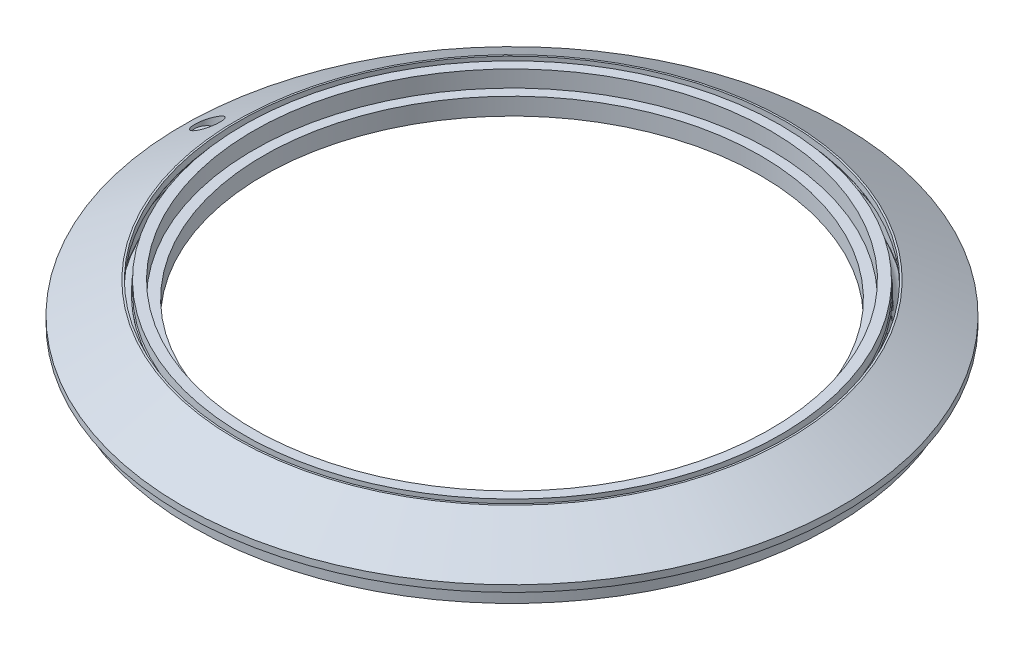
ISO-10303-21;
HEADER;
FILE_DESCRIPTION(('STEP AP214'),'2;1');
FILE_NAME('part.step','',(''),(''),'','','');
FILE_SCHEMA(('AUTOMOTIVE_DESIGN { 1 0 10303 214 1 1 1 1 }'));
ENDSEC;
DATA;
#1=APPLICATION_CONTEXT('core data for automotive mechanical design processes');
#2=APPLICATION_PROTOCOL_DEFINITION('international standard','automotive_design',2000,#1);
#3=PRODUCT_CONTEXT('',#1,'mechanical');
#4=PRODUCT('Part','Part','',(#3));
#5=PRODUCT_RELATED_PRODUCT_CATEGORY('part','',(#4));
#6=PRODUCT_DEFINITION_FORMATION('','',#4);
#7=PRODUCT_DEFINITION_CONTEXT('part definition',#1,'design');
#8=PRODUCT_DEFINITION('design','',#6,#7);
#9=PRODUCT_DEFINITION_SHAPE('','',#8);
#10=(LENGTH_UNIT() NAMED_UNIT(*) SI_UNIT(.MILLI.,.METRE.));
#11=(NAMED_UNIT(*) PLANE_ANGLE_UNIT() SI_UNIT($,.RADIAN.));
#12=(NAMED_UNIT(*) SI_UNIT($,.STERADIAN.) SOLID_ANGLE_UNIT());
#13=UNCERTAINTY_MEASURE_WITH_UNIT(LENGTH_MEASURE(1.E-05),#10,'distance_accuracy_value','');
#14=(GEOMETRIC_REPRESENTATION_CONTEXT(3) GLOBAL_UNCERTAINTY_ASSIGNED_CONTEXT((#13)) GLOBAL_UNIT_ASSIGNED_CONTEXT((#10,
#11,#12)) REPRESENTATION_CONTEXT('',''));
#15=CARTESIAN_POINT('',(0.,0.,0.));
#16=DIRECTION('',(0.,0.,1.));
#17=DIRECTION('',(1.,0.,0.));
#18=AXIS2_PLACEMENT_3D('',#15,#16,#17);
#19=CARTESIAN_POINT('',(0.,12.0652767497325,0.));
#20=DIRECTION('',(0.,-1.,0.));
#21=DIRECTION('',(0.,0.,-1.));
#22=AXIS2_PLACEMENT_3D('',#19,#20,#21);
#23=TOROIDAL_SURFACE('',#22,84.7733166849342,3.62499999999997);
#24=CARTESIAN_POINT('',(0.,12.9178402591936,0.));
#25=DIRECTION('',(0.,-1.,0.));
#26=DIRECTION('',(0.,0.,-1.));
#27=AXIS2_PLACEMENT_3D('',#24,#25,#26);
#28=CIRCLE('',#27,81.25);
#29=CARTESIAN_POINT('',(0.,12.9178402591936,-81.25));
#30=VERTEX_POINT('',#29);
#31=EDGE_CURVE('E87',#30,#30,#28,.T.);
#32=ORIENTED_EDGE('',*,*,#31,.T.);
#33=EDGE_LOOP('',(#32));
#34=FACE_BOUND('',#33,.T.);
#35=CARTESIAN_POINT('',(0.,8.58771324027138,0.));
#36=DIRECTION('',(0.,-1.,0.));
#37=DIRECTION('',(0.,0.,-1.));
#38=AXIS2_PLACEMENT_3D('',#35,#36,#37);
#39=CIRCLE('',#38,83.75);
#40=CARTESIAN_POINT('',(0.,8.58771324027138,-83.75));
#41=VERTEX_POINT('',#40);
#42=EDGE_CURVE('E11',#41,#41,#39,.T.);
#43=ORIENTED_EDGE('',*,*,#42,.F.);
#44=EDGE_LOOP('',(#43));
#45=FACE_BOUND('',#44,.T.);
#46=ADVANCED_FACE('F53',(#34,#45),#23,.F.);
#47=CARTESIAN_POINT('',(0.,8.15470053837915,0.));
#48=DIRECTION('',(0.,-1.,0.));
#49=DIRECTION('',(0.,0.,-1.));
#50=AXIS2_PLACEMENT_3D('',#47,#48,#49);
#51=CONICAL_SURFACE('',#50,84.0000000000001,0.523598775598318);
#52=ORIENTED_EDGE('',*,*,#42,.T.);
#53=EDGE_LOOP('',(#52));
#54=FACE_BOUND('',#53,.T.);
#55=CARTESIAN_POINT('',(0.,8.15470053837915,0.));
#56=DIRECTION('',(0.,-1.,0.));
#57=DIRECTION('',(0.,0.,-1.));
#58=AXIS2_PLACEMENT_3D('',#55,#56,#57);
#59=CIRCLE('',#58,84.0000000000001);
#60=CARTESIAN_POINT('',(0.,8.15470053837915,-84.0000000000001));
#61=VERTEX_POINT('',#60);
#62=EDGE_CURVE('E59',#61,#61,#59,.T.);
#63=ORIENTED_EDGE('',*,*,#62,.F.);
#64=EDGE_LOOP('',(#63));
#65=FACE_BOUND('',#64,.T.);
#66=ADVANCED_FACE('F105',(#54,#65),#51,.T.);
#67=CARTESIAN_POINT('',(0.,0.,0.));
#68=DIRECTION('',(0.,-1.,0.));
#69=DIRECTION('',(0.,0.,-1.));
#70=AXIS2_PLACEMENT_3D('',#67,#68,#69);
#71=CYLINDRICAL_SURFACE('',#70,84.);
#72=ORIENTED_EDGE('',*,*,#62,.T.);
#73=EDGE_LOOP('',(#72));
#74=FACE_BOUND('',#73,.T.);
#75=CARTESIAN_POINT('',(0.,6.15470053837916,0.));
#76=DIRECTION('',(0.,-1.,0.));
#77=DIRECTION('',(0.,0.,-1.));
#78=AXIS2_PLACEMENT_3D('',#75,#76,#77);
#79=CIRCLE('',#78,84.);
#80=CARTESIAN_POINT('',(0.,6.15470053837916,-84.));
#81=VERTEX_POINT('',#80);
#82=EDGE_CURVE('E63',#81,#81,#79,.T.);
#83=ORIENTED_EDGE('',*,*,#82,.F.);
#84=EDGE_LOOP('',(#83));
#85=FACE_BOUND('',#84,.T.);
#86=ADVANCED_FACE('F109',(#74,#85),#71,.T.);
#87=CARTESIAN_POINT('',(0.,6.15470053837916,0.));
#88=DIRECTION('',(0.,-1.,0.));
#89=DIRECTION('',(0.,0.,-1.));
#90=AXIS2_PLACEMENT_3D('',#87,#88,#89);
#91=PLANE('',#90);
#92=ORIENTED_EDGE('',*,*,#82,.T.);
#93=EDGE_LOOP('',(#92));
#94=FACE_BOUND('',#93,.T.);
#95=CARTESIAN_POINT('',(0.,6.15470053837916,0.));
#96=DIRECTION('',(0.,-1.,0.));
#97=DIRECTION('',(0.,0.,-1.));
#98=AXIS2_PLACEMENT_3D('',#95,#96,#97);
#99=CIRCLE('',#98,75.);
#100=CARTESIAN_POINT('',(0.,6.15470053837916,-75.));
#101=VERTEX_POINT('',#100);
#102=EDGE_CURVE('E67',#101,#101,#99,.T.);
#103=ORIENTED_EDGE('',*,*,#102,.F.);
#104=EDGE_LOOP('',(#103));
#105=FACE_BOUND('',#104,.T.);
#106=ADVANCED_FACE('F113',(#94,#105),#91,.T.);
#107=CARTESIAN_POINT('',(0.,0.,0.));
#108=DIRECTION('',(0.,-1.,0.));
#109=DIRECTION('',(0.,0.,-1.));
#110=AXIS2_PLACEMENT_3D('',#107,#108,#109);
#111=CYLINDRICAL_SURFACE('',#110,75.);
#112=ORIENTED_EDGE('',*,*,#102,.T.);
#113=EDGE_LOOP('',(#112));
#114=FACE_BOUND('',#113,.T.);
#115=CARTESIAN_POINT('',(0.,11.3508529610858,0.));
#116=DIRECTION('',(0.,-1.,0.));
#117=DIRECTION('',(0.,0.,-1.));
#118=AXIS2_PLACEMENT_3D('',#115,#116,#117);
#119=CIRCLE('',#118,75.);
#120=CARTESIAN_POINT('',(0.,11.3508529610858,-75.));
#121=VERTEX_POINT('',#120);
#122=EDGE_CURVE('E72',#121,#121,#119,.T.);
#123=ORIENTED_EDGE('',*,*,#122,.F.);
#124=EDGE_LOOP('',(#123));
#125=FACE_BOUND('',#124,.T.);
#126=ADVANCED_FACE('F119',(#114,#125),#111,.F.);
#127=CARTESIAN_POINT('',(0.,11.3508529610858,0.));
#128=DIRECTION('',(0.,1.,0.));
#129=DIRECTION('',(0.,0.,1.));
#130=AXIS2_PLACEMENT_3D('',#127,#128,#129);
#131=PLANE('',#130);
#132=ORIENTED_EDGE('',*,*,#122,.T.);
#133=EDGE_LOOP('',(#132));
#134=FACE_BOUND('',#133,.T.);
#135=CARTESIAN_POINT('',(0.,11.3508529610858,0.));
#136=DIRECTION('',(0.,-1.,0.));
#137=DIRECTION('',(0.,0.,-1.));
#138=AXIS2_PLACEMENT_3D('',#135,#136,#137);
#139=CIRCLE('',#138,78.);
#140=CARTESIAN_POINT('',(0.,11.3508529610858,-78.));
#141=VERTEX_POINT('',#140);
#142=EDGE_CURVE('E75',#141,#141,#139,.T.);
#143=ORIENTED_EDGE('',*,*,#142,.F.);
#144=EDGE_LOOP('',(#143));
#145=FACE_BOUND('',#144,.T.);
#146=ADVANCED_FACE('F123',(#134,#145),#131,.T.);
#147=CARTESIAN_POINT('',(0.,0.,0.));
#148=DIRECTION('',(0.,-1.,0.));
#149=DIRECTION('',(0.,0.,-1.));
#150=AXIS2_PLACEMENT_3D('',#147,#148,#149);
#151=CYLINDRICAL_SURFACE('',#150,78.);
#152=ORIENTED_EDGE('',*,*,#142,.T.);
#153=EDGE_LOOP('',(#152));
#154=FACE_BOUND('',#153,.T.);
#155=CARTESIAN_POINT('',(0.,16.3508529610858,0.));
#156=DIRECTION('',(0.,-1.,0.));
#157=DIRECTION('',(0.,0.,-1.));
#158=AXIS2_PLACEMENT_3D('',#155,#156,#157);
#159=CIRCLE('',#158,78.);
#160=CARTESIAN_POINT('',(0.,16.3508529610858,-78.));
#161=VERTEX_POINT('',#160);
#162=EDGE_CURVE('E78',#161,#161,#159,.T.);
#163=ORIENTED_EDGE('',*,*,#162,.F.);
#164=EDGE_LOOP('',(#163));
#165=FACE_BOUND('',#164,.T.);
#166=ADVANCED_FACE('F127',(#154,#165),#151,.F.);
#167=CARTESIAN_POINT('',(0.,16.3508529610858,0.));
#168=DIRECTION('',(0.,1.,0.));
#169=DIRECTION('',(0.,0.,1.));
#170=AXIS2_PLACEMENT_3D('',#167,#168,#169);
#171=PLANE('',#170);
#172=ORIENTED_EDGE('',*,*,#162,.T.);
#173=EDGE_LOOP('',(#172));
#174=FACE_BOUND('',#173,.T.);
#175=CARTESIAN_POINT('',(0.,16.3508529610858,0.));
#176=DIRECTION('',(0.,-1.,0.));
#177=DIRECTION('',(0.,0.,-1.));
#178=AXIS2_PLACEMENT_3D('',#175,#176,#177);
#179=CIRCLE('',#178,81.);
#180=CARTESIAN_POINT('',(0.,16.3508529610858,-81.));
#181=VERTEX_POINT('',#180);
#182=EDGE_CURVE('E81',#181,#181,#179,.T.);
#183=ORIENTED_EDGE('',*,*,#182,.F.);
#184=EDGE_LOOP('',(#183));
#185=FACE_BOUND('',#184,.T.);
#186=ADVANCED_FACE('F101',(#174,#185),#171,.T.);
#187=CARTESIAN_POINT('',(0.,0.,0.));
#188=DIRECTION('',(0.,-1.,0.));
#189=DIRECTION('',(0.,0.,-1.));
#190=AXIS2_PLACEMENT_3D('',#187,#188,#189);
#191=CYLINDRICAL_SURFACE('',#190,81.);
#192=ORIENTED_EDGE('',*,*,#182,.T.);
#193=EDGE_LOOP('',(#192));
#194=FACE_BOUND('',#193,.T.);
#195=CARTESIAN_POINT('',(0.,13.3508529610858,0.));
#196=DIRECTION('',(0.,-1.,0.));
#197=DIRECTION('',(0.,0.,-1.));
#198=AXIS2_PLACEMENT_3D('',#195,#196,#197);
#199=CIRCLE('',#198,81.0000000000001);
#200=CARTESIAN_POINT('',(0.,13.3508529610858,-81.0000000000001));
#201=VERTEX_POINT('',#200);
#202=EDGE_CURVE('E84',#201,#201,#199,.T.);
#203=ORIENTED_EDGE('',*,*,#202,.F.);
#204=EDGE_LOOP('',(#203));
#205=FACE_BOUND('',#204,.T.);
#206=ADVANCED_FACE('F95',(#194,#205),#191,.T.);
#207=CARTESIAN_POINT('',(0.,12.9178402591936,0.));
#208=DIRECTION('',(0.,-1.,0.));
#209=DIRECTION('',(0.,0.,-1.));
#210=AXIS2_PLACEMENT_3D('',#207,#208,#209);
#211=CONICAL_SURFACE('',#210,81.25,0.523598775598277);
#212=ORIENTED_EDGE('',*,*,#202,.T.);
#213=EDGE_LOOP('',(#212));
#214=FACE_BOUND('',#213,.T.);
#215=ORIENTED_EDGE('',*,*,#31,.F.);
#216=EDGE_LOOP('',(#215));
#217=FACE_BOUND('',#216,.T.);
#218=ADVANCED_FACE('F93',(#214,#217),#211,.T.);
#219=CLOSED_SHELL('',(#46,#66,#86,#106,#126,#146,#166,#186,#206,#218));
#220=MANIFOLD_SOLID_BREP('B2',#219);
#221=CARTESIAN_POINT('',(0.,9.58771324027141,0.));
#222=DIRECTION('',(0.,-1.,0.));
#223=DIRECTION('',(0.,0.,-1.));
#224=AXIS2_PLACEMENT_3D('',#221,#222,#223);
#225=CONICAL_SURFACE('',#224,85.4820508075689,0.523598775598321);
#226=CARTESIAN_POINT('',(0.,9.15470053837914,0.));
#227=DIRECTION('',(0.,-1.,0.));
#228=DIRECTION('',(0.,0.,-1.));
#229=AXIS2_PLACEMENT_3D('',#226,#227,#228);
#230=CIRCLE('',#229,85.732050807569);
#231=CARTESIAN_POINT('',(0.,9.15470053837914,-85.732050807569));
#232=VERTEX_POINT('',#231);
#233=EDGE_CURVE('E247',#232,#232,#230,.T.);
#234=ORIENTED_EDGE('',*,*,#233,.T.);
#235=EDGE_LOOP('',(#234));
#236=FACE_BOUND('',#235,.T.);
#237=CARTESIAN_POINT('',(0.,9.58771324027141,0.));
#238=DIRECTION('',(0.,-1.,0.));
#239=DIRECTION('',(0.,0.,-1.));
#240=AXIS2_PLACEMENT_3D('',#237,#238,#239);
#241=CIRCLE('',#240,85.4820508075689);
#242=CARTESIAN_POINT('',(0.,9.58771324027141,-85.4820508075689));
#243=VERTEX_POINT('',#242);
#244=EDGE_CURVE('E52',#243,#243,#241,.T.);
#245=ORIENTED_EDGE('',*,*,#244,.F.);
#246=EDGE_LOOP('',(#245));
#247=FACE_BOUND('',#246,.T.);
#248=ADVANCED_FACE('F207',(#236,#247),#225,.F.);
#249=CARTESIAN_POINT('',(0.,10.4402767497325,0.));
#250=DIRECTION('',(0.,-1.,0.));
#251=DIRECTION('',(0.,0.,-1.));
#252=AXIS2_PLACEMENT_3D('',#249,#250,#251);
#253=TOROIDAL_SURFACE('',#252,81.9587341226348,3.62499999999997);
#254=CARTESIAN_POINT('',(0.,13.9178402591936,0.));
#255=DIRECTION('',(0.,-1.,0.));
#256=DIRECTION('',(0.,0.,-1.));
#257=AXIS2_PLACEMENT_3D('',#254,#255,#256);
#258=CIRCLE('',#257,82.9820508075689);
#259=CARTESIAN_POINT('',(0.,13.9178402591936,-82.9820508075689));
#260=VERTEX_POINT('',#259);
#261=EDGE_CURVE('E220',#260,#260,#258,.T.);
#262=ORIENTED_EDGE('',*,*,#261,.F.);
#263=EDGE_LOOP('',(#262));
#264=FACE_BOUND('',#263,.T.);
#265=ORIENTED_EDGE('',*,*,#244,.T.);
#266=EDGE_LOOP('',(#265));
#267=FACE_BOUND('',#266,.T.);
#268=ADVANCED_FACE('F291',(#264,#267),#253,.F.);
#269=CARTESIAN_POINT('',(0.,14.3508529610858,0.));
#270=DIRECTION('',(0.,-1.,0.));
#271=DIRECTION('',(0.,0.,-1.));
#272=AXIS2_PLACEMENT_3D('',#269,#270,#271);
#273=CONICAL_SURFACE('',#272,82.7320508075689,0.523598775598314);
#274=ORIENTED_EDGE('',*,*,#261,.T.);
#275=EDGE_LOOP('',(#274));
#276=FACE_BOUND('',#275,.T.);
#277=CARTESIAN_POINT('',(0.,14.3508529610858,0.));
#278=DIRECTION('',(0.,-1.,0.));
#279=DIRECTION('',(0.,0.,-1.));
#280=AXIS2_PLACEMENT_3D('',#277,#278,#279);
#281=CIRCLE('',#280,82.7320508075689);
#282=CARTESIAN_POINT('',(0.,14.3508529610858,-82.7320508075689));
#283=VERTEX_POINT('',#282);
#284=EDGE_CURVE('E226',#283,#283,#281,.T.);
#285=ORIENTED_EDGE('',*,*,#284,.F.);
#286=EDGE_LOOP('',(#285));
#287=FACE_BOUND('',#286,.T.);
#288=ADVANCED_FACE('F289',(#276,#287),#273,.F.);
#289=CARTESIAN_POINT('',(0.,0.,0.));
#290=DIRECTION('',(0.,-1.,0.));
#291=DIRECTION('',(0.,0.,-1.));
#292=AXIS2_PLACEMENT_3D('',#289,#290,#291);
#293=CYLINDRICAL_SURFACE('',#292,82.7320508075689);
#294=ORIENTED_EDGE('',*,*,#284,.T.);
#295=EDGE_LOOP('',(#294));
#296=FACE_BOUND('',#295,.T.);
#297=CARTESIAN_POINT('',(0.,16.3508529610858,0.));
#298=DIRECTION('',(0.,-1.,0.));
#299=DIRECTION('',(0.,0.,-1.));
#300=AXIS2_PLACEMENT_3D('',#297,#298,#299);
#301=CIRCLE('',#300,82.7320508075689);
#302=CARTESIAN_POINT('',(0.,16.3508529610858,-82.7320508075689));
#303=VERTEX_POINT('',#302);
#304=EDGE_CURVE('E279',#303,#303,#301,.T.);
#305=ORIENTED_EDGE('',*,*,#304,.F.);
#306=EDGE_LOOP('',(#305));
#307=FACE_BOUND('',#306,.T.);
#308=ADVANCED_FACE('F286',(#296,#307),#293,.F.);
#309=CARTESIAN_POINT('',(-7.40996670247368E-13,16.3508529610858,0.));
#310=DIRECTION('',(0.,1.,0.));
#311=DIRECTION('',(0.,0.,1.));
#312=AXIS2_PLACEMENT_3D('',#309,#310,#311);
#313=PLANE('',#312);
#314=ORIENTED_EDGE('',*,*,#304,.T.);
#315=EDGE_LOOP('',(#314));
#316=FACE_BOUND('',#315,.T.);
#317=CARTESIAN_POINT('',(0.,16.3508529610858,0.));
#318=DIRECTION('',(0.,-1.,0.));
#319=DIRECTION('',(0.,0.,-1.));
#320=AXIS2_PLACEMENT_3D('',#317,#318,#319);
#321=CIRCLE('',#320,83.2679491924311);
#322=CARTESIAN_POINT('',(0.,16.3508529610858,-83.2679491924311));
#323=VERTEX_POINT('',#322);
#324=EDGE_CURVE('E275',#323,#323,#321,.T.);
#325=ORIENTED_EDGE('',*,*,#324,.F.);
#326=EDGE_LOOP('',(#325));
#327=FACE_BOUND('',#326,.T.);
#328=ADVANCED_FACE('F298',(#316,#327),#313,.T.);
#329=CARTESIAN_POINT('',(0.,6.99999999999999,0.));
#330=DIRECTION('',(0.,-1.,0.));
#331=DIRECTION('',(0.,0.,-1.));
#332=AXIS2_PLACEMENT_3D('',#329,#330,#331);
#333=CONICAL_SURFACE('',#332,99.4641016151378,1.0471975511966);
#334=CARTESIAN_POINT('',(-94.8191806815134,9.662604411564,-2.50769286890235));
#335=CARTESIAN_POINT('',(-94.9461840648199,9.59151161045793,-2.36309420373943));
#336=CARTESIAN_POINT('',(-95.0635646519706,9.52594451322483,-2.2072583358046));
#337=CARTESIAN_POINT('',(-95.2747522118784,9.4081485019498,-1.87568707209136));
#338=CARTESIAN_POINT('',(-95.3685584411718,9.35592000856607,-1.69995104897597));
#339=CARTESIAN_POINT('',(-95.5287594268285,9.26681538536667,-1.33178799954502));
#340=CARTESIAN_POINT('',(-95.5950413499641,9.23000244503541,-1.13929610647826));
#341=CARTESIAN_POINT('',(-95.69617934174,9.17386042533167,-0.743779542484753));
#342=CARTESIAN_POINT('',(-95.7310476902126,9.15452451403091,-0.540759020138945));
#343=CARTESIAN_POINT('',(-95.7662663166927,9.13499503753669,-0.143878702458985));
#344=CARTESIAN_POINT('',(-95.768665354485,9.13366530906824,0.0497455710446283));
#345=CARTESIAN_POINT('',(-95.7440942325413,9.14728959615883,0.434511464141637));
#346=CARTESIAN_POINT('',(-95.717128849841,9.16224096309164,0.625653482432767));
#347=CARTESIAN_POINT('',(-95.6363419374051,9.2070722471166,0.99466387838082));
#348=CARTESIAN_POINT('',(-95.5832842764252,9.23652758083817,1.1727532046294));
#349=CARTESIAN_POINT('',(-95.4530565501767,9.30890996802954,1.51692705839243));
#350=CARTESIAN_POINT('',(-95.3758831102762,9.35183890692659,1.68300990177691));
#351=CARTESIAN_POINT('',(-95.1959376567945,9.45208775745615,2.00784798754446));
#352=CARTESIAN_POINT('',(-95.0920588795479,9.5100310601085,2.16579484803134));
#353=CARTESIAN_POINT('',(-94.8647909730967,9.63704229939674,2.46188490887273));
#354=CARTESIAN_POINT('',(-94.7413945944661,9.70611436977123,2.60002071430846));
#355=CARTESIAN_POINT('',(-94.4648333527038,9.8612572516391,2.86832764750287));
#356=CARTESIAN_POINT('',(-94.3098969426256,9.94835551917104,2.9960751500961));
#357=CARTESIAN_POINT('',(-93.9854944411101,10.13120547933,3.22386598148373));
#358=CARTESIAN_POINT('',(-93.8160214196566,10.2269613004485,3.32389599935342));
#359=CARTESIAN_POINT('',(-93.4444640405154,10.4374985678676,3.50666094470785));
#360=CARTESIAN_POINT('',(-93.2409795249859,10.5531477306068,3.58555340692218));
#361=CARTESIAN_POINT('',(-92.8263520066236,10.7895988740054,3.70719162949744));
#362=CARTESIAN_POINT('',(-92.6152052359055,10.9104033950756,3.74991934774215));
#363=CARTESIAN_POINT('',(-92.1673062317769,11.1675570129266,3.80194630419252));
#364=CARTESIAN_POINT('',(-91.9302331294605,11.3041855006239,3.80717625461056));
#365=CARTESIAN_POINT('',(-91.4588563975743,11.5769013352718,3.77367834644071));
#366=CARTESIAN_POINT('',(-91.2245539775392,11.7129884298395,3.73493195747953));
#367=CARTESIAN_POINT('',(-90.7553234544132,11.9865634902298,3.6110950305382));
#368=CARTESIAN_POINT('',(-90.5207646300145,12.1238795679246,3.52416703363076));
#369=CARTESIAN_POINT('',(-90.1822240747745,12.3228049594921,3.35868374675041));
#370=CARTESIAN_POINT('',(-90.0715240885013,12.3879797649277,3.29762162128033));
#371=CARTESIAN_POINT('',(-89.8555802480224,12.5153457214214,3.16389582208456));
#372=CARTESIAN_POINT('',(-89.7503333033436,12.5775385609632,3.09123881709177));
#373=CARTESIAN_POINT('',(-89.5521790309328,12.6948318369818,2.93893825683769));
#374=CARTESIAN_POINT('',(-89.4589105346885,12.7501344521287,2.85991987625209));
#375=CARTESIAN_POINT('',(-89.2793168698279,12.8567823002951,2.69203031616307));
#376=CARTESIAN_POINT('',(-89.1929876992008,12.9081298135561,2.60316488696745));
#377=CARTESIAN_POINT('',(-89.0283857578339,13.0061669731789,2.41600774859418));
#378=CARTESIAN_POINT('',(-88.9501078941674,13.0528595634723,2.31772207524962));
#379=CARTESIAN_POINT('',(-88.8027257847417,13.1408795012487,2.11226786919626));
#380=CARTESIAN_POINT('',(-88.7336195836862,13.1822079922566,2.00510123774816));
#381=CARTESIAN_POINT('',(-88.6147583321476,13.2533659638498,1.7983475323852));
#382=CARTESIAN_POINT('',(-88.5636486239295,13.2839952122068,1.69981265062352));
#383=CARTESIAN_POINT('',(-88.4698196143658,13.3402680169876,1.49747204001066));
#384=CARTESIAN_POINT('',(-88.4270985430493,13.3659126251403,1.39366742888245));
#385=CARTESIAN_POINT('',(-88.3507628947277,13.4117628072814,1.18171842031659));
#386=CARTESIAN_POINT('',(-88.3171392019953,13.4319738256885,1.07357849266343));
#387=CARTESIAN_POINT('',(-88.2595348581878,13.466614265894,0.853859927415895));
#388=CARTESIAN_POINT('',(-88.2355526958624,13.4810445937786,0.742281831687387));
#389=CARTESIAN_POINT('',(-88.2004425617685,13.5021760380691,0.533295124278121));
#390=CARTESIAN_POINT('',(-88.1879490729486,13.5096980278903,0.436196194941045));
#391=CARTESIAN_POINT('',(-88.1704890510431,13.5202111757293,0.241045442906081));
#392=CARTESIAN_POINT('',(-88.1655248059729,13.523200956482,0.142993339660342));
#393=CARTESIAN_POINT('',(-88.1632093016682,13.5245954148344,-0.0531653561044435));
#394=CARTESIAN_POINT('',(-88.1658523721863,13.5230035074766,-0.15127185357258));
#395=CARTESIAN_POINT('',(-88.1786904850142,13.5152727581866,-0.346819864433527));
#396=CARTESIAN_POINT('',(-88.1888882890177,13.5091322534781,-0.44426112149283));
#397=CARTESIAN_POINT('',(-88.2288602814827,13.4850704167667,-0.722029278432349));
#398=CARTESIAN_POINT('',(-88.2679486668168,13.4615466392798,-0.900643959897374));
#399=CARTESIAN_POINT('',(-88.3703131225879,13.4000122950712,-1.24801929959135));
#400=CARTESIAN_POINT('',(-88.4335912269672,13.3620005101561,-1.41677912781957));
#401=CARTESIAN_POINT('',(-88.5846409279981,13.2714007722139,-1.74745059856787));
#402=CARTESIAN_POINT('',(-88.6732957160607,13.2182878031881,-1.90881336567245));
#403=CARTESIAN_POINT('',(-88.8704594627065,13.1003937290386,-2.21414953910129));
#404=CARTESIAN_POINT('',(-88.9789759290634,13.0356082118019,-2.35811633541636));
#405=CARTESIAN_POINT('',(-89.2256224205043,12.8886800562356,-2.64195842237237));
#406=CARTESIAN_POINT('',(-89.3657121366244,12.8054038403702,-2.7795401828076));
#407=CARTESIAN_POINT('',(-89.6618514251235,12.6298396607046,-3.02939525244849));
#408=CARTESIAN_POINT('',(-89.8179091551572,12.5375470917774,-3.14165553076134));
#409=CARTESIAN_POINT('',(-90.1648784886867,12.3329402433922,-3.35406642358094));
#410=CARTESIAN_POINT('',(-90.3576063117267,12.2196348781089,-3.45029894861509));
#411=CARTESIAN_POINT('',(-90.7536114173887,11.9876206732463,-3.60835479939894));
#412=CARTESIAN_POINT('',(-90.9568937904535,11.8689092297804,-3.67016134982315));
#413=CARTESIAN_POINT('',(-91.3936879365512,11.6147219672447,-3.76433390411136));
#414=CARTESIAN_POINT('',(-91.627945228016,11.4789152106432,-3.79238765591431));
#415=CARTESIAN_POINT('',(-92.0979160405122,11.2075099748672,-3.8049182992309));
#416=CARTESIAN_POINT('',(-92.3336304464128,11.0719117011403,-3.78936543220456));
#417=CARTESIAN_POINT('',(-92.8112363197326,10.7981866042477,-3.71262452776476));
#418=CARTESIAN_POINT('',(-93.0528977703834,10.6602402491937,-3.64932697378366));
#419=CARTESIAN_POINT('',(-93.5230256629824,10.3928593439666,-3.47454683686624));
#420=CARTESIAN_POINT('',(-93.7515088174294,10.2634139827301,-3.36312687600189));
#421=CARTESIAN_POINT('',(-94.124338257185,10.0528762480924,-3.13159443068495));
#422=CARTESIAN_POINT('',(-94.2740897406691,9.96852589430734,-3.02303328415736));
#423=CARTESIAN_POINT('',(-94.5587486164299,9.80852261275846,-2.78252907662021));
#424=CARTESIAN_POINT('',(-94.69366405758,9.73286496800344,-2.65059879631953));
#425=CARTESIAN_POINT('',(-94.8191806815134,9.662604411564,-2.50769286890235));
#426=B_SPLINE_CURVE_WITH_KNOTS('',3,(#334,#335,#336,#337,#338,#339,#340,#341,#342,#343,#344,
#345,#346,#347,#348,#349,#350,#351,#352,#353,#354,#355,#356,#357,#358,#359,#360,#361,#362,#363,
#364,#365,#366,#367,#368,#369,#370,#371,#372,#373,#374,#375,#376,#377,#378,#379,#380,#381,#382,
#383,#384,#385,#386,#387,#388,#389,#390,#391,#392,#393,#394,#395,#396,#397,#398,#399,#400,#401,
#402,#403,#404,#405,#406,#407,#408,#409,#410,#411,#412,#413,#414,#415,#416,#417,#418,#419,#420,
#421,#422,#423,#424,#425),.UNSPECIFIED.,.T.,.F.,(4,2,2,2,2,2,2,2,2,2,2,2,2,2,2,2,2,2,2,2,2,2,2,
2,2,2,2,2,2,2,2,2,2,2,2,2,2,2,2,2,2,2,2,2,2,4),(0.,0.614885839885751,1.2297910689707,
1.84719273434855,2.46435294733569,3.04237557439927,3.62030418216222,4.18223918758225,
4.74425286239196,5.33499154805919,5.92595016940238,6.57998195741925,7.23432729260708,
7.97227320465309,8.71058705159821,9.52795685285282,10.3456711983033,11.1969588415144,
11.6231718128638,12.049140527763,12.4510842083427,12.8527943936713,13.2542488903139,
13.6556176633701,14.00056520982,14.3454398952397,14.6899677197139,15.0344415204997,
15.3286216163974,15.6228910909673,15.9169412833877,16.2110990213037,16.7614094804484,
17.3117662214857,17.8842703626681,18.4569913607519,19.094318386371,19.7319726474943,
20.459226618175,21.1868346608299,21.9999312061344,22.8135827693452,23.6654579020875,
24.5162278072754,25.1242470219548,25.7319347285153),.UNSPECIFIED.);
#427=CARTESIAN_POINT('',(-94.8191806815134,9.662604411564,-2.50769286890235));
#428=VERTEX_POINT('',#427);
#429=EDGE_CURVE('E210',#428,#428,#426,.T.);
#430=ORIENTED_EDGE('',*,*,#429,.F.);
#431=EDGE_LOOP('',(#430));
#432=FACE_BOUND('',#431,.T.);
#433=ORIENTED_EDGE('',*,*,#324,.T.);
#434=EDGE_LOOP('',(#433));
#435=FACE_BOUND('',#434,.T.);
#436=CARTESIAN_POINT('',(0.,6.99999999999999,0.));
#437=DIRECTION('',(0.,-1.,0.));
#438=DIRECTION('',(0.,0.,-1.));
#439=AXIS2_PLACEMENT_3D('',#436,#437,#438);
#440=CIRCLE('',#439,99.4641016151378);
#441=CARTESIAN_POINT('',(0.,6.99999999999999,-99.4641016151378));
#442=VERTEX_POINT('',#441);
#443=EDGE_CURVE('E271',#442,#442,#440,.T.);
#444=ORIENTED_EDGE('',*,*,#443,.F.);
#445=EDGE_LOOP('',(#444));
#446=FACE_BOUND('',#445,.T.);
#447=ADVANCED_FACE('F337',(#432,#435,#446),#333,.T.);
#448=CARTESIAN_POINT('',(0.,0.,0.));
#449=DIRECTION('',(0.,-1.,0.));
#450=DIRECTION('',(0.,0.,-1.));
#451=AXIS2_PLACEMENT_3D('',#448,#449,#450);
#452=CYLINDRICAL_SURFACE('',#451,99.4641016151378);
#453=CARTESIAN_POINT('',(0.,4.99999999999999,0.));
#454=DIRECTION('',(0.,-1.,0.));
#455=DIRECTION('',(0.,0.,-1.));
#456=AXIS2_PLACEMENT_3D('',#453,#454,#455);
#457=CIRCLE('',#456,99.4641016151378);
#458=CARTESIAN_POINT('',(0.,4.99999999999999,-99.4641016151378));
#459=VERTEX_POINT('',#458);
#460=EDGE_CURVE('E267',#459,#459,#457,.T.);
#461=ORIENTED_EDGE('',*,*,#460,.F.);
#462=EDGE_LOOP('',(#461));
#463=FACE_BOUND('',#462,.T.);
#464=ORIENTED_EDGE('',*,*,#443,.T.);
#465=EDGE_LOOP('',(#464));
#466=FACE_BOUND('',#465,.T.);
#467=ADVANCED_FACE('F334',(#463,#466),#452,.T.);
#468=CARTESIAN_POINT('',(0.,4.99999999999999,0.));
#469=DIRECTION('',(0.,1.,0.));
#470=DIRECTION('',(0.,0.,1.));
#471=AXIS2_PLACEMENT_3D('',#468,#469,#470);
#472=PLANE('',#471);
#473=CARTESIAN_POINT('',(0.,4.99999999999999,0.));
#474=DIRECTION('',(0.,-1.,0.));
#475=DIRECTION('',(0.,0.,-1.));
#476=AXIS2_PLACEMENT_3D('',#473,#474,#475);
#477=CIRCLE('',#476,96.4641016151378);
#478=CARTESIAN_POINT('',(0.,4.99999999999999,-96.4641016151378));
#479=VERTEX_POINT('',#478);
#480=EDGE_CURVE('E263',#479,#479,#477,.T.);
#481=ORIENTED_EDGE('',*,*,#480,.F.);
#482=EDGE_LOOP('',(#481));
#483=FACE_BOUND('',#482,.T.);
#484=ORIENTED_EDGE('',*,*,#460,.T.);
#485=EDGE_LOOP('',(#484));
#486=FACE_BOUND('',#485,.T.);
#487=ADVANCED_FACE('F330',(#483,#486),#472,.F.);
#488=CARTESIAN_POINT('',(0.,0.,0.));
#489=DIRECTION('',(0.,-1.,0.));
#490=DIRECTION('',(0.,0.,-1.));
#491=AXIS2_PLACEMENT_3D('',#488,#489,#490);
#492=CYLINDRICAL_SURFACE('',#491,96.4641016151378);
#493=CARTESIAN_POINT('',(0.,0.,0.));
#494=DIRECTION('',(0.,-1.,0.));
#495=DIRECTION('',(0.,0.,-1.));
#496=AXIS2_PLACEMENT_3D('',#493,#494,#495);
#497=CIRCLE('',#496,96.4641016151378);
#498=CARTESIAN_POINT('',(0.,0.,-96.4641016151378));
#499=VERTEX_POINT('',#498);
#500=EDGE_CURVE('E259',#499,#499,#497,.T.);
#501=ORIENTED_EDGE('',*,*,#500,.F.);
#502=EDGE_LOOP('',(#501));
#503=FACE_BOUND('',#502,.T.);
#504=ORIENTED_EDGE('',*,*,#480,.T.);
#505=EDGE_LOOP('',(#504));
#506=FACE_BOUND('',#505,.T.);
#507=ADVANCED_FACE('F326',(#503,#506),#492,.T.);
#508=CARTESIAN_POINT('',(0.,0.,0.));
#509=DIRECTION('',(0.,1.,0.));
#510=DIRECTION('',(0.,0.,1.));
#511=AXIS2_PLACEMENT_3D('',#508,#509,#510);
#512=PLANE('',#511);
#513=CARTESIAN_POINT('',(-91.9641016151378,0.,0.));
#514=DIRECTION('',(0.,-1.,0.));
#515=DIRECTION('',(0.,0.,-1.));
#516=AXIS2_PLACEMENT_3D('',#513,#514,#515);
#517=CIRCLE('',#516,2.);
#518=CARTESIAN_POINT('',(-91.9641016151378,0.,-2.));
#519=VERTEX_POINT('',#518);
#520=EDGE_CURVE('E238',#519,#519,#517,.T.);
#521=ORIENTED_EDGE('',*,*,#520,.F.);
#522=EDGE_LOOP('',(#521));
#523=FACE_BOUND('',#522,.T.);
#524=CARTESIAN_POINT('',(0.,0.,0.));
#525=DIRECTION('',(0.,-1.,0.));
#526=DIRECTION('',(0.,0.,-1.));
#527=AXIS2_PLACEMENT_3D('',#524,#525,#526);
#528=CIRCLE('',#527,87.4641016151377);
#529=CARTESIAN_POINT('',(0.,0.,-87.4641016151377));
#530=VERTEX_POINT('',#529);
#531=EDGE_CURVE('E255',#530,#530,#528,.T.);
#532=ORIENTED_EDGE('',*,*,#531,.F.);
#533=EDGE_LOOP('',(#532));
#534=FACE_BOUND('',#533,.T.);
#535=ORIENTED_EDGE('',*,*,#500,.T.);
#536=EDGE_LOOP('',(#535));
#537=FACE_BOUND('',#536,.T.);
#538=ADVANCED_FACE('F321',(#523,#534,#537),#512,.F.);
#539=CARTESIAN_POINT('',(0.,0.,0.));
#540=DIRECTION('',(0.,-1.,0.));
#541=DIRECTION('',(0.,0.,-1.));
#542=AXIS2_PLACEMENT_3D('',#539,#540,#541);
#543=CYLINDRICAL_SURFACE('',#542,87.4641016151378);
#544=ORIENTED_EDGE('',*,*,#531,.T.);
#545=EDGE_LOOP('',(#544));
#546=FACE_BOUND('',#545,.T.);
#547=CARTESIAN_POINT('',(0.,8.15470053837915,0.));
#548=DIRECTION('',(0.,-1.,0.));
#549=DIRECTION('',(0.,0.,-1.));
#550=AXIS2_PLACEMENT_3D('',#547,#548,#549);
#551=CIRCLE('',#550,87.4641016151378);
#552=CARTESIAN_POINT('',(0.,8.15470053837915,-87.4641016151378));
#553=VERTEX_POINT('',#552);
#554=EDGE_CURVE('E251',#553,#553,#551,.T.);
#555=ORIENTED_EDGE('',*,*,#554,.F.);
#556=EDGE_LOOP('',(#555));
#557=FACE_BOUND('',#556,.T.);
#558=ADVANCED_FACE('F311',(#546,#557),#543,.F.);
#559=CARTESIAN_POINT('',(0.,9.15470053837914,0.));
#560=DIRECTION('',(0.,-1.,0.));
#561=DIRECTION('',(0.,0.,-1.));
#562=AXIS2_PLACEMENT_3D('',#559,#560,#561);
#563=CONICAL_SURFACE('',#562,85.732050807569,1.0471975511966);
#564=ORIENTED_EDGE('',*,*,#554,.T.);
#565=EDGE_LOOP('',(#564));
#566=FACE_BOUND('',#565,.T.);
#567=ORIENTED_EDGE('',*,*,#233,.F.);
#568=EDGE_LOOP('',(#567));
#569=FACE_BOUND('',#568,.T.);
#570=ADVANCED_FACE('F308',(#566,#569),#563,.F.);
#571=CARTESIAN_POINT('',(-91.9641016151378,16.3518529610858,0.));
#572=DIRECTION('',(0.,-1.,0.));
#573=DIRECTION('',(0.,0.,-1.));
#574=AXIS2_PLACEMENT_3D('',#571,#572,#573);
#575=CYLINDRICAL_SURFACE('',#574,2.);
#576=CARTESIAN_POINT('',(-91.9641016151378,8.,0.));
#577=DIRECTION('',(0.,-1.,0.));
#578=DIRECTION('',(0.,0.,-1.));
#579=AXIS2_PLACEMENT_3D('',#576,#577,#578);
#580=CIRCLE('',#579,2.);
#581=CARTESIAN_POINT('',(-91.9641016151378,8.,-2.));
#582=VERTEX_POINT('',#581);
#583=EDGE_CURVE('E229',#582,#582,#580,.F.);
#584=ORIENTED_EDGE('',*,*,#583,.T.);
#585=EDGE_LOOP('',(#584));
#586=FACE_BOUND('',#585,.T.);
#587=ORIENTED_EDGE('',*,*,#520,.T.);
#588=EDGE_LOOP('',(#587));
#589=FACE_BOUND('',#588,.T.);
#590=ADVANCED_FACE('F310',(#586,#589),#575,.F.);
#591=CARTESIAN_POINT('',(-91.9641016151378,8.,0.));
#592=DIRECTION('',(0.,-1.,0.));
#593=DIRECTION('',(0.,0.,-1.));
#594=AXIS2_PLACEMENT_3D('',#591,#592,#593);
#595=PLANE('',#594);
#596=CARTESIAN_POINT('',(-91.9641016151378,8.,0.));
#597=DIRECTION('',(0.,-1.,0.));
#598=DIRECTION('',(0.,0.,-1.));
#599=AXIS2_PLACEMENT_3D('',#596,#597,#598);
#600=CIRCLE('',#599,3.8);
#601=CARTESIAN_POINT('',(-91.9641016151378,8.,-3.8));
#602=VERTEX_POINT('',#601);
#603=EDGE_CURVE('E232',#602,#602,#600,.T.);
#604=ORIENTED_EDGE('',*,*,#603,.F.);
#605=EDGE_LOOP('',(#604));
#606=FACE_BOUND('',#605,.T.);
#607=ORIENTED_EDGE('',*,*,#583,.F.);
#608=EDGE_LOOP('',(#607));
#609=FACE_BOUND('',#608,.T.);
#610=ADVANCED_FACE('F319',(#606,#609),#595,.F.);
#611=CARTESIAN_POINT('',(-91.9641016151378,18.,0.));
#612=DIRECTION('',(0.,-1.,0.));
#613=DIRECTION('',(0.,0.,-1.));
#614=AXIS2_PLACEMENT_3D('',#611,#612,#613);
#615=CYLINDRICAL_SURFACE('',#614,3.8);
#616=ORIENTED_EDGE('',*,*,#429,.T.);
#617=EDGE_LOOP('',(#616));
#618=FACE_BOUND('',#617,.T.);
#619=ORIENTED_EDGE('',*,*,#603,.T.);
#620=EDGE_LOOP('',(#619));
#621=FACE_BOUND('',#620,.T.);
#622=ADVANCED_FACE('F401',(#618,#621),#615,.F.);
#623=CLOSED_SHELL('',(#248,#268,#288,#308,#328,#447,#467,#487,#507,#538,#558,#570,#590,#610,#622));
#624=MANIFOLD_SOLID_BREP('B6',#623);
#625=ADVANCED_BREP_SHAPE_REPRESENTATION('',(#18,#220,#624),#14);
#626=SHAPE_DEFINITION_REPRESENTATION(#9,#625);
ENDSEC;
END-ISO-10303-21;
